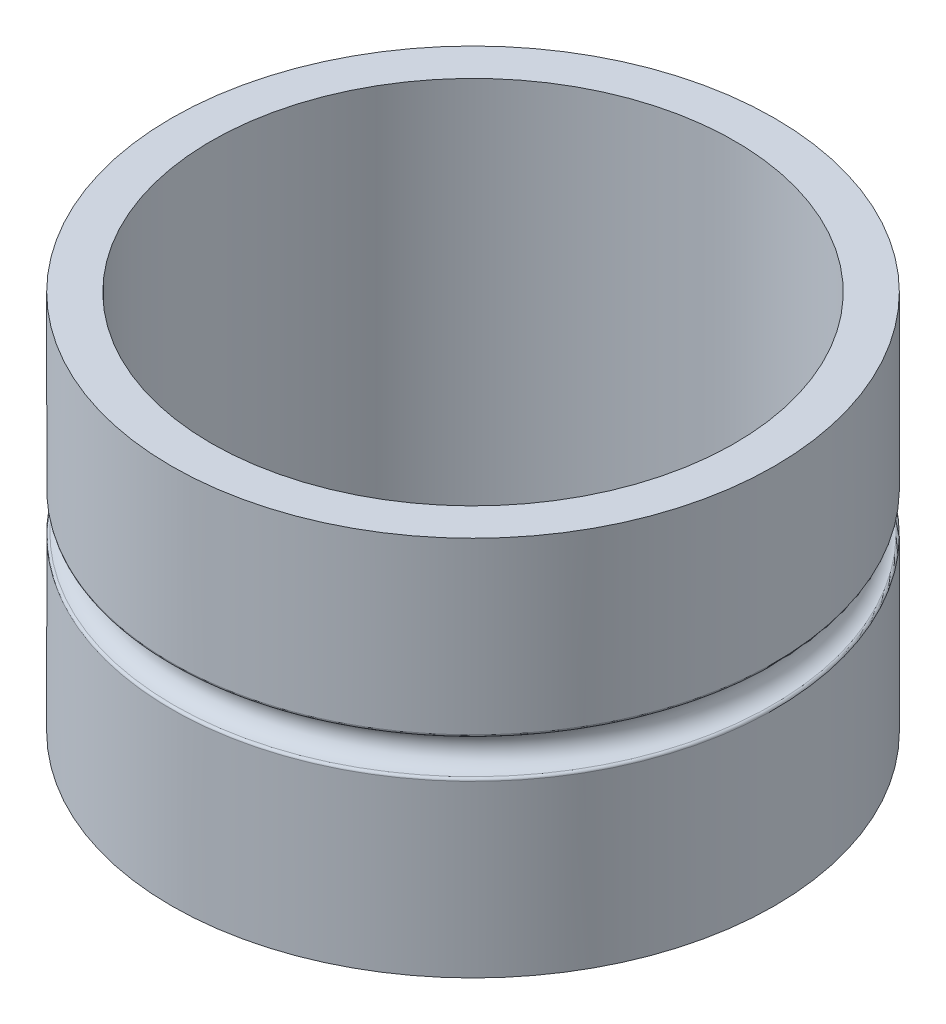
ISO-10303-21;
HEADER;
FILE_DESCRIPTION(('STEP AP214'),'2;1');
FILE_NAME('part.step','',(''),(''),'','','');
FILE_SCHEMA(('AUTOMOTIVE_DESIGN { 1 0 10303 214 1 1 1 1 }'));
ENDSEC;
DATA;
#1=APPLICATION_CONTEXT('core data for automotive mechanical design processes');
#2=APPLICATION_PROTOCOL_DEFINITION('international standard','automotive_design',2000,#1);
#3=PRODUCT_CONTEXT('',#1,'mechanical');
#4=PRODUCT('Part','Part','',(#3));
#5=PRODUCT_RELATED_PRODUCT_CATEGORY('part','',(#4));
#6=PRODUCT_DEFINITION_FORMATION('','',#4);
#7=PRODUCT_DEFINITION_CONTEXT('part definition',#1,'design');
#8=PRODUCT_DEFINITION('design','',#6,#7);
#9=PRODUCT_DEFINITION_SHAPE('','',#8);
#10=(LENGTH_UNIT() NAMED_UNIT(*) SI_UNIT(.MILLI.,.METRE.));
#11=(NAMED_UNIT(*) PLANE_ANGLE_UNIT() SI_UNIT($,.RADIAN.));
#12=(NAMED_UNIT(*) SI_UNIT($,.STERADIAN.) SOLID_ANGLE_UNIT());
#13=UNCERTAINTY_MEASURE_WITH_UNIT(LENGTH_MEASURE(1.E-05),#10,'distance_accuracy_value','');
#14=(GEOMETRIC_REPRESENTATION_CONTEXT(3) GLOBAL_UNCERTAINTY_ASSIGNED_CONTEXT((#13)) GLOBAL_UNIT_ASSIGNED_CONTEXT((#10,
#11,#12)) REPRESENTATION_CONTEXT('',''));
#15=CARTESIAN_POINT('',(0.,0.,0.));
#16=DIRECTION('',(0.,0.,1.));
#17=DIRECTION('',(1.,0.,0.));
#18=AXIS2_PLACEMENT_3D('',#15,#16,#17);
#19=CARTESIAN_POINT('',(0.,76.2,0.));
#20=DIRECTION('',(0.,-1.,0.));
#21=DIRECTION('',(0.,0.,-1.));
#22=AXIS2_PLACEMENT_3D('',#19,#20,#21);
#23=CYLINDRICAL_SURFACE('',#22,60.325);
#24=CARTESIAN_POINT('',(0.,42.1321249980624,0.));
#25=DIRECTION('',(0.,-1.,0.));
#26=DIRECTION('',(0.,0.,-1.));
#27=AXIS2_PLACEMENT_3D('',#24,#25,#26);
#28=CIRCLE('',#27,60.325);
#29=CARTESIAN_POINT('',(0.,42.1321249980624,-60.325));
#30=VERTEX_POINT('',#29);
#31=EDGE_CURVE('E46',#30,#30,#28,.F.);
#32=ORIENTED_EDGE('',*,*,#31,.T.);
#33=EDGE_LOOP('',(#32));
#34=FACE_BOUND('',#33,.T.);
#35=CARTESIAN_POINT('',(0.,76.2,0.));
#36=DIRECTION('',(0.,1.,0.));
#37=DIRECTION('',(0.,0.,1.));
#38=AXIS2_PLACEMENT_3D('',#35,#36,#37);
#39=CIRCLE('',#38,60.325);
#40=CARTESIAN_POINT('',(0.,76.2,60.325));
#41=VERTEX_POINT('',#40);
#42=EDGE_CURVE('E51',#41,#41,#39,.T.);
#43=ORIENTED_EDGE('',*,*,#42,.F.);
#44=EDGE_LOOP('',(#43));
#45=FACE_BOUND('',#44,.T.);
#46=ADVANCED_FACE('F31',(#34,#45),#23,.T.);
#47=CARTESIAN_POINT('',(0.,34.0678750019376,0.));
#48=DIRECTION('',(0.,-1.,0.));
#49=DIRECTION('',(0.,0.,-1.));
#50=AXIS2_PLACEMENT_3D('',#47,#48,#49);
#51=CIRCLE('',#50,60.325);
#52=CARTESIAN_POINT('',(0.,34.0678750019376,-60.325));
#53=VERTEX_POINT('',#52);
#54=EDGE_CURVE('E10',#53,#53,#51,.T.);
#55=ORIENTED_EDGE('',*,*,#54,.T.);
#56=EDGE_LOOP('',(#55));
#57=FACE_BOUND('',#56,.T.);
#58=CARTESIAN_POINT('',(0.,0.,0.));
#59=DIRECTION('',(0.,1.,0.));
#60=DIRECTION('',(0.,0.,1.));
#61=AXIS2_PLACEMENT_3D('',#58,#59,#60);
#62=CIRCLE('',#61,60.325);
#63=CARTESIAN_POINT('',(0.,0.,60.325));
#64=VERTEX_POINT('',#63);
#65=EDGE_CURVE('E52',#64,#64,#62,.T.);
#66=ORIENTED_EDGE('',*,*,#65,.T.);
#67=EDGE_LOOP('',(#66));
#68=FACE_BOUND('',#67,.T.);
#69=ADVANCED_FACE('F70',(#57,#68),#23,.T.);
#70=CARTESIAN_POINT('',(0.,76.2,0.));
#71=DIRECTION('',(0.,1.,0.));
#72=DIRECTION('',(0.,0.,1.));
#73=AXIS2_PLACEMENT_3D('',#70,#71,#72);
#74=PLANE('',#73);
#75=ORIENTED_EDGE('',*,*,#42,.T.);
#76=EDGE_LOOP('',(#75));
#77=FACE_BOUND('',#76,.T.);
#78=CARTESIAN_POINT('',(0.,76.2,0.));
#79=DIRECTION('',(0.,1.,0.));
#80=DIRECTION('',(0.,0.,1.));
#81=AXIS2_PLACEMENT_3D('',#78,#79,#80);
#82=CIRCLE('',#81,52.3875);
#83=CARTESIAN_POINT('',(0.,76.2,52.3875));
#84=VERTEX_POINT('',#83);
#85=EDGE_CURVE('E55',#84,#84,#82,.T.);
#86=ORIENTED_EDGE('',*,*,#85,.F.);
#87=EDGE_LOOP('',(#86));
#88=FACE_BOUND('',#87,.T.);
#89=ADVANCED_FACE('F67',(#77,#88),#74,.T.);
#90=CARTESIAN_POINT('',(0.,0.,0.));
#91=DIRECTION('',(0.,1.,0.));
#92=DIRECTION('',(0.,0.,1.));
#93=AXIS2_PLACEMENT_3D('',#90,#91,#92);
#94=PLANE('',#93);
#95=ORIENTED_EDGE('',*,*,#65,.F.);
#96=EDGE_LOOP('',(#95));
#97=FACE_BOUND('',#96,.T.);
#98=CARTESIAN_POINT('',(0.,0.,0.));
#99=DIRECTION('',(0.,1.,0.));
#100=DIRECTION('',(0.,0.,1.));
#101=AXIS2_PLACEMENT_3D('',#98,#99,#100);
#102=CIRCLE('',#101,52.3875);
#103=CARTESIAN_POINT('',(0.,0.,52.3875));
#104=VERTEX_POINT('',#103);
#105=EDGE_CURVE('E58',#104,#104,#102,.T.);
#106=ORIENTED_EDGE('',*,*,#105,.T.);
#107=EDGE_LOOP('',(#106));
#108=FACE_BOUND('',#107,.T.);
#109=ADVANCED_FACE('F69',(#97,#108),#94,.F.);
#110=CARTESIAN_POINT('',(0.,76.2,0.));
#111=DIRECTION('',(0.,-1.,0.));
#112=DIRECTION('',(0.,0.,-1.));
#113=AXIS2_PLACEMENT_3D('',#110,#111,#112);
#114=CYLINDRICAL_SURFACE('',#113,52.3875);
#115=ORIENTED_EDGE('',*,*,#85,.T.);
#116=EDGE_LOOP('',(#115));
#117=FACE_BOUND('',#116,.T.);
#118=ORIENTED_EDGE('',*,*,#105,.F.);
#119=EDGE_LOOP('',(#118));
#120=FACE_BOUND('',#119,.T.);
#121=ADVANCED_FACE('F64',(#117,#120),#114,.F.);
#122=CARTESIAN_POINT('',(0.,38.1,0.));
#123=DIRECTION('',(0.,1.,0.));
#124=DIRECTION('',(0.,0.,1.));
#125=AXIS2_PLACEMENT_3D('',#122,#123,#124);
#126=TOROIDAL_SURFACE('',#125,60.325,3.556);
#127=CARTESIAN_POINT('',(0.,41.6281093733039,0.));
#128=DIRECTION('',(0.,-1.,0.));
#129=DIRECTION('',(0.,0.,-1.));
#130=AXIS2_PLACEMENT_3D('',#127,#128,#129);
#131=CIRCLE('',#130,59.8805000000001);
#132=CARTESIAN_POINT('',(0.,41.6281093733039,-59.8805000000001));
#133=VERTEX_POINT('',#132);
#134=EDGE_CURVE('E38',#133,#133,#131,.T.);
#135=ORIENTED_EDGE('',*,*,#134,.T.);
#136=EDGE_LOOP('',(#135));
#137=FACE_BOUND('',#136,.T.);
#138=CARTESIAN_POINT('',(0.,34.5718906266961,0.));
#139=DIRECTION('',(0.,1.,0.));
#140=DIRECTION('',(0.,0.,1.));
#141=AXIS2_PLACEMENT_3D('',#138,#139,#140);
#142=CIRCLE('',#141,59.8805000000001);
#143=CARTESIAN_POINT('',(0.,34.5718906266961,59.8805000000001));
#144=VERTEX_POINT('',#143);
#145=EDGE_CURVE('E42',#144,#144,#142,.T.);
#146=ORIENTED_EDGE('',*,*,#145,.T.);
#147=EDGE_LOOP('',(#146));
#148=FACE_BOUND('',#147,.T.);
#149=ADVANCED_FACE('F88',(#137,#148),#126,.F.);
#150=CARTESIAN_POINT('',(0.,42.1321249980624,0.));
#151=DIRECTION('',(0.,-1.,0.));
#152=DIRECTION('',(0.,0.,-1.));
#153=AXIS2_PLACEMENT_3D('',#150,#151,#152);
#154=TOROIDAL_SURFACE('',#153,59.817,0.508);
#155=ORIENTED_EDGE('',*,*,#134,.F.);
#156=EDGE_LOOP('',(#155));
#157=FACE_BOUND('',#156,.T.);
#158=ORIENTED_EDGE('',*,*,#31,.F.);
#159=EDGE_LOOP('',(#158));
#160=FACE_BOUND('',#159,.T.);
#161=ADVANCED_FACE('F86',(#157,#160),#154,.T.);
#162=CARTESIAN_POINT('',(0.,34.0678750019376,0.));
#163=DIRECTION('',(0.,-1.,0.));
#164=DIRECTION('',(0.,0.,-1.));
#165=AXIS2_PLACEMENT_3D('',#162,#163,#164);
#166=TOROIDAL_SURFACE('',#165,59.817,0.508);
#167=ORIENTED_EDGE('',*,*,#54,.F.);
#168=EDGE_LOOP('',(#167));
#169=FACE_BOUND('',#168,.T.);
#170=ORIENTED_EDGE('',*,*,#145,.F.);
#171=EDGE_LOOP('',(#170));
#172=FACE_BOUND('',#171,.T.);
#173=ADVANCED_FACE('F33',(#169,#172),#166,.T.);
#174=CLOSED_SHELL('',(#46,#69,#89,#109,#121,#149,#161,#173));
#175=MANIFOLD_SOLID_BREP('B2',#174);
#176=ADVANCED_BREP_SHAPE_REPRESENTATION('',(#18,#175),#14);
#177=SHAPE_DEFINITION_REPRESENTATION(#9,#176);
ENDSEC;
END-ISO-10303-21;
